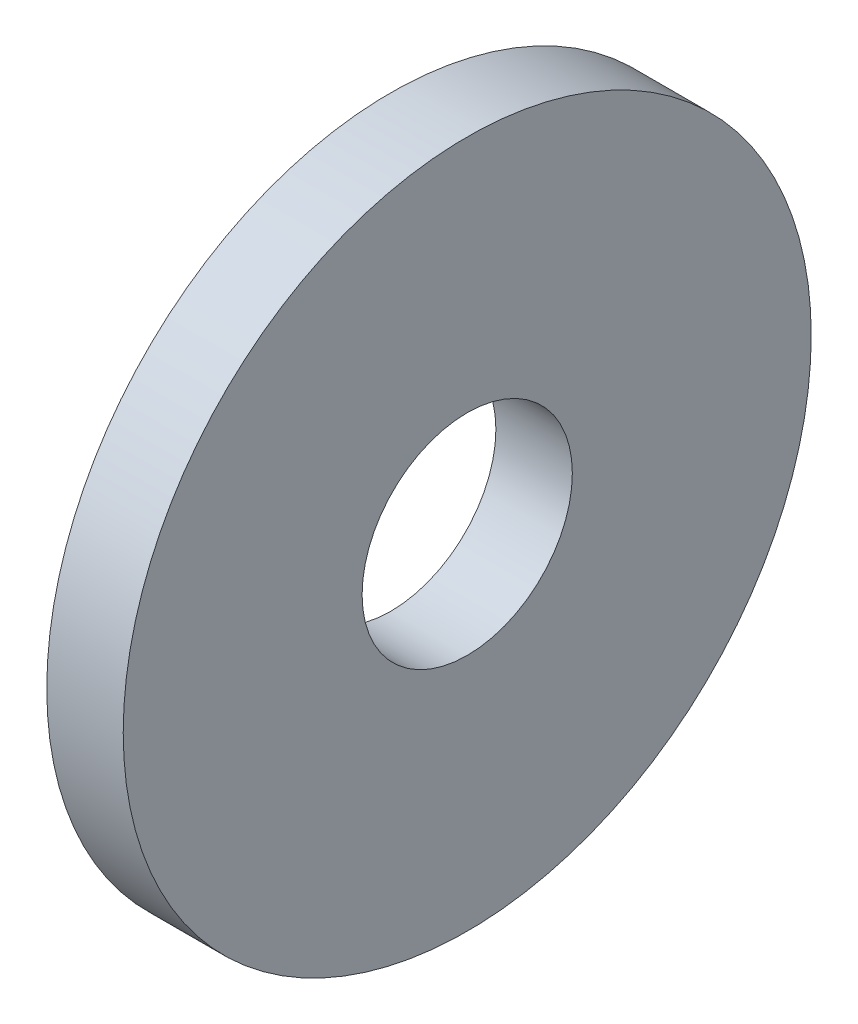
ISO-10303-21;
HEADER;
FILE_DESCRIPTION(('STEP AP214'),'2;1');
FILE_NAME('part.step','',(''),(''),'','','');
FILE_SCHEMA(('AUTOMOTIVE_DESIGN { 1 0 10303 214 1 1 1 1 }'));
ENDSEC;
DATA;
#1=APPLICATION_CONTEXT('core data for automotive mechanical design processes');
#2=APPLICATION_PROTOCOL_DEFINITION('international standard','automotive_design',2000,#1);
#3=PRODUCT_CONTEXT('',#1,'mechanical');
#4=PRODUCT('Part','Part','',(#3));
#5=PRODUCT_RELATED_PRODUCT_CATEGORY('part','',(#4));
#6=PRODUCT_DEFINITION_FORMATION('','',#4);
#7=PRODUCT_DEFINITION_CONTEXT('part definition',#1,'design');
#8=PRODUCT_DEFINITION('design','',#6,#7);
#9=PRODUCT_DEFINITION_SHAPE('','',#8);
#10=(LENGTH_UNIT() NAMED_UNIT(*) SI_UNIT(.MILLI.,.METRE.));
#11=(NAMED_UNIT(*) PLANE_ANGLE_UNIT() SI_UNIT($,.RADIAN.));
#12=(NAMED_UNIT(*) SI_UNIT($,.STERADIAN.) SOLID_ANGLE_UNIT());
#13=UNCERTAINTY_MEASURE_WITH_UNIT(LENGTH_MEASURE(1.E-05),#10,'distance_accuracy_value','');
#14=(GEOMETRIC_REPRESENTATION_CONTEXT(3) GLOBAL_UNCERTAINTY_ASSIGNED_CONTEXT((#13)) GLOBAL_UNIT_ASSIGNED_CONTEXT((#10,
#11,#12)) REPRESENTATION_CONTEXT('',''));
#15=CARTESIAN_POINT('',(0.,0.,0.));
#16=DIRECTION('',(0.,0.,1.));
#17=DIRECTION('',(1.,0.,0.));
#18=AXIS2_PLACEMENT_3D('',#15,#16,#17);
#19=CARTESIAN_POINT('',(-34.9249999999999,0.,0.));
#20=DIRECTION('',(-1.,0.,0.));
#21=DIRECTION('',(0.,0.,1.));
#22=AXIS2_PLACEMENT_3D('',#19,#20,#21);
#23=CYLINDRICAL_SURFACE('',#22,2.75);
#24=CARTESIAN_POINT('',(0.,0.,0.));
#25=DIRECTION('',(-1.,0.,0.));
#26=DIRECTION('',(0.,0.,1.));
#27=AXIS2_PLACEMENT_3D('',#24,#25,#26);
#28=CIRCLE('',#27,2.75);
#29=CARTESIAN_POINT('',(0.,0.,2.75));
#30=VERTEX_POINT('',#29);
#31=EDGE_CURVE('E10',#30,#30,#28,.T.);
#32=ORIENTED_EDGE('',*,*,#31,.F.);
#33=EDGE_LOOP('',(#32));
#34=FACE_BOUND('',#33,.T.);
#35=CARTESIAN_POINT('',(-2.,0.,0.));
#36=DIRECTION('',(-1.,0.,0.));
#37=DIRECTION('',(0.,0.,1.));
#38=AXIS2_PLACEMENT_3D('',#35,#36,#37);
#39=CIRCLE('',#38,2.75);
#40=CARTESIAN_POINT('',(-2.,0.,2.75));
#41=VERTEX_POINT('',#40);
#42=EDGE_CURVE('E45',#41,#41,#39,.T.);
#43=ORIENTED_EDGE('',*,*,#42,.T.);
#44=EDGE_LOOP('',(#43));
#45=FACE_BOUND('',#44,.T.);
#46=ADVANCED_FACE('F31',(#34,#45),#23,.F.);
#47=CARTESIAN_POINT('',(0.,2.75,0.));
#48=DIRECTION('',(-1.,0.,0.));
#49=DIRECTION('',(0.,0.,1.));
#50=AXIS2_PLACEMENT_3D('',#47,#48,#49);
#51=PLANE('',#50);
#52=CARTESIAN_POINT('',(0.,0.,0.));
#53=DIRECTION('',(-1.,0.,0.));
#54=DIRECTION('',(0.,0.,1.));
#55=AXIS2_PLACEMENT_3D('',#52,#53,#54);
#56=CIRCLE('',#55,9.);
#57=CARTESIAN_POINT('',(0.,0.,9.));
#58=VERTEX_POINT('',#57);
#59=EDGE_CURVE('E37',#58,#58,#56,.T.);
#60=ORIENTED_EDGE('',*,*,#59,.F.);
#61=EDGE_LOOP('',(#60));
#62=FACE_BOUND('',#61,.T.);
#63=ORIENTED_EDGE('',*,*,#31,.T.);
#64=EDGE_LOOP('',(#63));
#65=FACE_BOUND('',#64,.T.);
#66=ADVANCED_FACE('F60',(#62,#65),#51,.F.);
#67=CARTESIAN_POINT('',(-34.9249999999999,0.,0.));
#68=DIRECTION('',(-1.,0.,0.));
#69=DIRECTION('',(0.,0.,1.));
#70=AXIS2_PLACEMENT_3D('',#67,#68,#69);
#71=CYLINDRICAL_SURFACE('',#70,9.);
#72=CARTESIAN_POINT('',(-2.,0.,0.));
#73=DIRECTION('',(-1.,0.,0.));
#74=DIRECTION('',(0.,0.,1.));
#75=AXIS2_PLACEMENT_3D('',#72,#73,#74);
#76=CIRCLE('',#75,9.);
#77=CARTESIAN_POINT('',(-2.,0.,9.));
#78=VERTEX_POINT('',#77);
#79=EDGE_CURVE('E41',#78,#78,#76,.T.);
#80=ORIENTED_EDGE('',*,*,#79,.F.);
#81=EDGE_LOOP('',(#80));
#82=FACE_BOUND('',#81,.T.);
#83=ORIENTED_EDGE('',*,*,#59,.T.);
#84=EDGE_LOOP('',(#83));
#85=FACE_BOUND('',#84,.T.);
#86=ADVANCED_FACE('F55',(#82,#85),#71,.T.);
#87=CARTESIAN_POINT('',(-2.,9.,0.));
#88=DIRECTION('',(1.,0.,0.));
#89=DIRECTION('',(0.,0.,-1.));
#90=AXIS2_PLACEMENT_3D('',#87,#88,#89);
#91=PLANE('',#90);
#92=ORIENTED_EDGE('',*,*,#42,.F.);
#93=EDGE_LOOP('',(#92));
#94=FACE_BOUND('',#93,.T.);
#95=ORIENTED_EDGE('',*,*,#79,.T.);
#96=EDGE_LOOP('',(#95));
#97=FACE_BOUND('',#96,.T.);
#98=ADVANCED_FACE('F52',(#94,#97),#91,.F.);
#99=CLOSED_SHELL('',(#46,#66,#86,#98));
#100=MANIFOLD_SOLID_BREP('B2',#99);
#101=ADVANCED_BREP_SHAPE_REPRESENTATION('',(#18,#100),#14);
#102=SHAPE_DEFINITION_REPRESENTATION(#9,#101);
ENDSEC;
END-ISO-10303-21;
